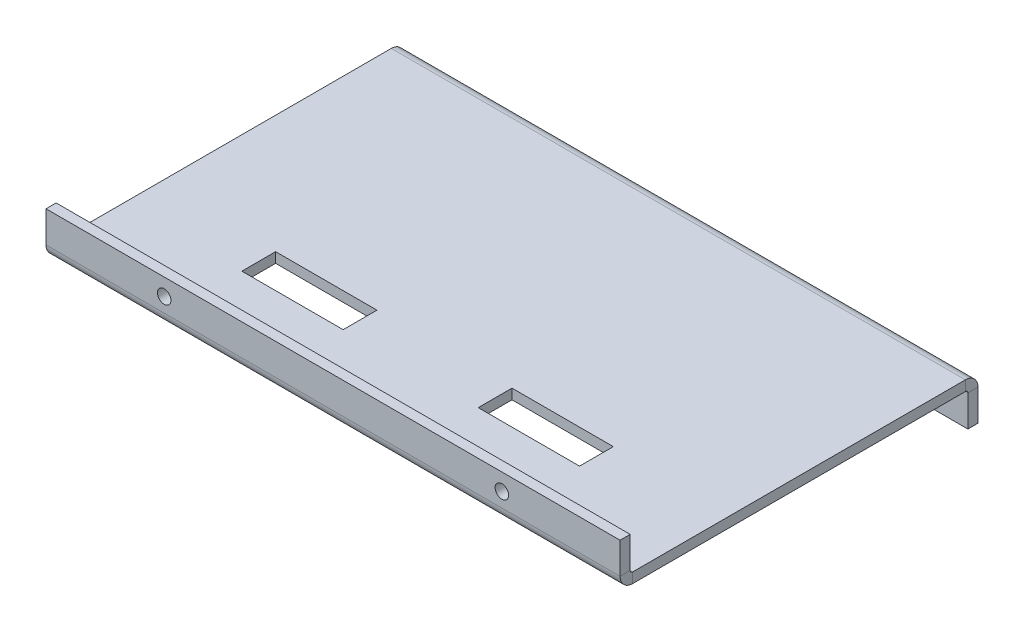
ISO-10303-21;
HEADER;
FILE_DESCRIPTION(('STEP AP214'),'2;1');
FILE_NAME('part.step','',(''),(''),'','','');
FILE_SCHEMA(('AUTOMOTIVE_DESIGN { 1 0 10303 214 1 1 1 1 }'));
ENDSEC;
DATA;
#1=APPLICATION_CONTEXT('core data for automotive mechanical design processes');
#2=APPLICATION_PROTOCOL_DEFINITION('international standard','automotive_design',2000,#1);
#3=PRODUCT_CONTEXT('',#1,'mechanical');
#4=PRODUCT('Part','Part','',(#3));
#5=PRODUCT_RELATED_PRODUCT_CATEGORY('part','',(#4));
#6=PRODUCT_DEFINITION_FORMATION('','',#4);
#7=PRODUCT_DEFINITION_CONTEXT('part definition',#1,'design');
#8=PRODUCT_DEFINITION('design','',#6,#7);
#9=PRODUCT_DEFINITION_SHAPE('','',#8);
#10=(LENGTH_UNIT() NAMED_UNIT(*) SI_UNIT(.MILLI.,.METRE.));
#11=(NAMED_UNIT(*) PLANE_ANGLE_UNIT() SI_UNIT($,.RADIAN.));
#12=(NAMED_UNIT(*) SI_UNIT($,.STERADIAN.) SOLID_ANGLE_UNIT());
#13=UNCERTAINTY_MEASURE_WITH_UNIT(LENGTH_MEASURE(1.E-05),#10,'distance_accuracy_value','');
#14=(GEOMETRIC_REPRESENTATION_CONTEXT(3) GLOBAL_UNCERTAINTY_ASSIGNED_CONTEXT((#13)) GLOBAL_UNIT_ASSIGNED_CONTEXT((#10,
#11,#12)) REPRESENTATION_CONTEXT('',''));
#15=CARTESIAN_POINT('',(0.,0.,0.));
#16=DIRECTION('',(0.,0.,1.));
#17=DIRECTION('',(1.,0.,0.));
#18=AXIS2_PLACEMENT_3D('',#15,#16,#17);
#19=CARTESIAN_POINT('',(85.,-3.,50.));
#20=DIRECTION('',(1.,0.,0.));
#21=DIRECTION('',(0.,0.,-1.));
#22=AXIS2_PLACEMENT_3D('',#19,#20,#21);
#23=PLANE('',#22);
#24=DIRECTION('',(0.,0.,-1.));
#25=VECTOR('',#24,1.);
#26=CARTESIAN_POINT('',(85.,-3.,50.));
#27=LINE('',#26,#25);
#28=CARTESIAN_POINT('',(85.,-3.,49.2634));
#29=VERTEX_POINT('',#28);
#30=CARTESIAN_POINT('',(85.,-3.00000000000001,-49.2634));
#31=VERTEX_POINT('',#30);
#32=EDGE_CURVE('E11',#29,#31,#27,.T.);
#33=ORIENTED_EDGE('',*,*,#32,.T.);
#34=DIRECTION('',(0.,1.,0.));
#35=VECTOR('',#34,1.);
#36=CARTESIAN_POINT('',(85.,-3.00000000000001,-49.2634));
#37=LINE('',#36,#35);
#38=CARTESIAN_POINT('',(85.,0.,-49.2634000000001));
#39=VERTEX_POINT('',#38);
#40=EDGE_CURVE('E311',#31,#39,#37,.T.);
#41=ORIENTED_EDGE('',*,*,#40,.T.);
#42=DIRECTION('',(0.,0.,-1.));
#43=VECTOR('',#42,1.);
#44=CARTESIAN_POINT('',(85.,0.,50.));
#45=LINE('',#44,#43);
#46=CARTESIAN_POINT('',(85.,0.,49.2634));
#47=VERTEX_POINT('',#46);
#48=EDGE_CURVE('E44',#47,#39,#45,.T.);
#49=ORIENTED_EDGE('',*,*,#48,.F.);
#50=DIRECTION('',(0.,-1.,0.));
#51=VECTOR('',#50,1.);
#52=CARTESIAN_POINT('',(85.,0.,49.2634));
#53=LINE('',#52,#51);
#54=EDGE_CURVE('E364',#47,#29,#53,.T.);
#55=ORIENTED_EDGE('',*,*,#54,.T.);
#56=EDGE_LOOP('',(#33,#41,#49,#55));
#57=FACE_BOUND('',#56,.T.);
#58=ADVANCED_FACE('F40',(#57),#23,.T.);
#59=CARTESIAN_POINT('',(0.,-3.,0.));
#60=DIRECTION('',(0.,1.,0.));
#61=DIRECTION('',(0.,0.,1.));
#62=AXIS2_PLACEMENT_3D('',#59,#60,#61);
#63=PLANE('',#62);
#64=DIRECTION('',(1.,0.,0.));
#65=VECTOR('',#64,1.);
#66=CARTESIAN_POINT('',(-50.,-3.,20.));
#67=LINE('',#66,#65);
#68=CARTESIAN_POINT('',(-50.,-3.,20.));
#69=VERTEX_POINT('',#68);
#70=CARTESIAN_POINT('',(-20.,-3.,20.));
#71=VERTEX_POINT('',#70);
#72=EDGE_CURVE('E203',#69,#71,#67,.T.);
#73=ORIENTED_EDGE('',*,*,#72,.F.);
#74=DIRECTION('',(0.,0.,-1.));
#75=VECTOR('',#74,1.);
#76=CARTESIAN_POINT('',(-50.,-3.,20.));
#77=LINE('',#76,#75);
#78=CARTESIAN_POINT('',(-50.,-3.,30.));
#79=VERTEX_POINT('',#78);
#80=EDGE_CURVE('E183',#79,#69,#77,.T.);
#81=ORIENTED_EDGE('',*,*,#80,.F.);
#82=DIRECTION('',(-1.,0.,0.));
#83=VECTOR('',#82,1.);
#84=CARTESIAN_POINT('',(-50.,-3.,30.));
#85=LINE('',#84,#83);
#86=CARTESIAN_POINT('',(-20.,-3.,30.));
#87=VERTEX_POINT('',#86);
#88=EDGE_CURVE('E194',#87,#79,#85,.T.);
#89=ORIENTED_EDGE('',*,*,#88,.F.);
#90=DIRECTION('',(0.,0.,1.));
#91=VECTOR('',#90,1.);
#92=CARTESIAN_POINT('',(-20.,-3.,20.));
#93=LINE('',#92,#91);
#94=EDGE_CURVE('E57',#71,#87,#93,.T.);
#95=ORIENTED_EDGE('',*,*,#94,.F.);
#96=EDGE_LOOP('',(#73,#81,#89,#95));
#97=FACE_BOUND('',#96,.T.);
#98=DIRECTION('',(-1.,0.,0.));
#99=VECTOR('',#98,1.);
#100=CARTESIAN_POINT('',(50.,-3.,29.9999999999999));
#101=LINE('',#100,#99);
#102=CARTESIAN_POINT('',(50.,-3.,29.9999999999999));
#103=VERTEX_POINT('',#102);
#104=CARTESIAN_POINT('',(20.,-3.,30.));
#105=VERTEX_POINT('',#104);
#106=EDGE_CURVE('E221',#103,#105,#101,.T.);
#107=ORIENTED_EDGE('',*,*,#106,.F.);
#108=DIRECTION('',(0.,0.,1.));
#109=VECTOR('',#108,1.);
#110=CARTESIAN_POINT('',(50.,-3.,19.9999999999999));
#111=LINE('',#110,#109);
#112=CARTESIAN_POINT('',(50.,-3.,19.9999999999999));
#113=VERTEX_POINT('',#112);
#114=EDGE_CURVE('E224',#113,#103,#111,.T.);
#115=ORIENTED_EDGE('',*,*,#114,.F.);
#116=DIRECTION('',(1.,0.,0.));
#117=VECTOR('',#116,1.);
#118=CARTESIAN_POINT('',(50.,-3.,19.9999999999999));
#119=LINE('',#118,#117);
#120=CARTESIAN_POINT('',(20.,-3.,20.));
#121=VERTEX_POINT('',#120);
#122=EDGE_CURVE('E241',#121,#113,#119,.T.);
#123=ORIENTED_EDGE('',*,*,#122,.F.);
#124=DIRECTION('',(0.,0.,-1.));
#125=VECTOR('',#124,1.);
#126=CARTESIAN_POINT('',(20.,-3.,20.));
#127=LINE('',#126,#125);
#128=EDGE_CURVE('E65',#105,#121,#127,.T.);
#129=ORIENTED_EDGE('',*,*,#128,.F.);
#130=EDGE_LOOP('',(#107,#115,#123,#129));
#131=FACE_BOUND('',#130,.T.);
#132=DIRECTION('',(1.,0.,0.));
#133=VECTOR('',#132,1.);
#134=CARTESIAN_POINT('',(85.,-3.00000000000001,-49.2634));
#135=LINE('',#134,#133);
#136=CARTESIAN_POINT('',(-85.,-3.00000000000001,-49.2634));
#137=VERTEX_POINT('',#136);
#138=EDGE_CURVE('E317',#31,#137,#135,.F.);
#139=ORIENTED_EDGE('',*,*,#138,.F.);
#140=ORIENTED_EDGE('',*,*,#32,.F.);
#141=DIRECTION('',(1.,0.,0.));
#142=VECTOR('',#141,1.);
#143=CARTESIAN_POINT('',(85.,-3.,49.2634));
#144=LINE('',#143,#142);
#145=CARTESIAN_POINT('',(-84.9999999999999,-3.,49.2634));
#146=VERTEX_POINT('',#145);
#147=EDGE_CURVE('E357',#29,#146,#144,.F.);
#148=ORIENTED_EDGE('',*,*,#147,.T.);
#149=DIRECTION('',(0.,0.,1.));
#150=VECTOR('',#149,1.);
#151=CARTESIAN_POINT('',(-85.,-3.,50.));
#152=LINE('',#151,#150);
#153=EDGE_CURVE('E49',#137,#146,#152,.T.);
#154=ORIENTED_EDGE('',*,*,#153,.F.);
#155=EDGE_LOOP('',(#139,#140,#148,#154));
#156=FACE_BOUND('',#155,.T.);
#157=ADVANCED_FACE('F200',(#97,#131,#156),#63,.F.);
#158=CARTESIAN_POINT('',(0.,0.,0.));
#159=DIRECTION('',(0.,1.,0.));
#160=DIRECTION('',(0.,0.,1.));
#161=AXIS2_PLACEMENT_3D('',#158,#159,#160);
#162=PLANE('',#161);
#163=DIRECTION('',(0.,0.,1.));
#164=VECTOR('',#163,1.);
#165=CARTESIAN_POINT('',(-50.,0.,20.));
#166=LINE('',#165,#164);
#167=CARTESIAN_POINT('',(-50.,0.,20.));
#168=VERTEX_POINT('',#167);
#169=CARTESIAN_POINT('',(-50.,0.,30.));
#170=VERTEX_POINT('',#169);
#171=EDGE_CURVE('E186',#168,#170,#166,.T.);
#172=ORIENTED_EDGE('',*,*,#171,.F.);
#173=DIRECTION('',(-1.,0.,0.));
#174=VECTOR('',#173,1.);
#175=CARTESIAN_POINT('',(-50.,0.,20.));
#176=LINE('',#175,#174);
#177=CARTESIAN_POINT('',(-20.,0.,20.));
#178=VERTEX_POINT('',#177);
#179=EDGE_CURVE('E191',#178,#168,#176,.T.);
#180=ORIENTED_EDGE('',*,*,#179,.F.);
#181=DIRECTION('',(0.,0.,-1.));
#182=VECTOR('',#181,1.);
#183=CARTESIAN_POINT('',(-20.,0.,20.));
#184=LINE('',#183,#182);
#185=CARTESIAN_POINT('',(-20.,0.,30.));
#186=VERTEX_POINT('',#185);
#187=EDGE_CURVE('E211',#186,#178,#184,.T.);
#188=ORIENTED_EDGE('',*,*,#187,.F.);
#189=DIRECTION('',(1.,0.,0.));
#190=VECTOR('',#189,1.);
#191=CARTESIAN_POINT('',(-50.,0.,30.));
#192=LINE('',#191,#190);
#193=EDGE_CURVE('E205',#170,#186,#192,.T.);
#194=ORIENTED_EDGE('',*,*,#193,.F.);
#195=EDGE_LOOP('',(#172,#180,#188,#194));
#196=FACE_BOUND('',#195,.T.);
#197=DIRECTION('',(0.,0.,-1.));
#198=VECTOR('',#197,1.);
#199=CARTESIAN_POINT('',(50.,0.,19.9999999999999));
#200=LINE('',#199,#198);
#201=CARTESIAN_POINT('',(50.,0.,29.9999999999999));
#202=VERTEX_POINT('',#201);
#203=CARTESIAN_POINT('',(50.,0.,19.9999999999999));
#204=VERTEX_POINT('',#203);
#205=EDGE_CURVE('E227',#202,#204,#200,.T.);
#206=ORIENTED_EDGE('',*,*,#205,.F.);
#207=DIRECTION('',(1.,0.,0.));
#208=VECTOR('',#207,1.);
#209=CARTESIAN_POINT('',(50.,0.,29.9999999999999));
#210=LINE('',#209,#208);
#211=CARTESIAN_POINT('',(20.,0.,30.));
#212=VERTEX_POINT('',#211);
#213=EDGE_CURVE('E235',#212,#202,#210,.T.);
#214=ORIENTED_EDGE('',*,*,#213,.F.);
#215=DIRECTION('',(0.,0.,1.));
#216=VECTOR('',#215,1.);
#217=CARTESIAN_POINT('',(20.,0.,20.));
#218=LINE('',#217,#216);
#219=CARTESIAN_POINT('',(20.,0.,20.));
#220=VERTEX_POINT('',#219);
#221=EDGE_CURVE('E232',#220,#212,#218,.T.);
#222=ORIENTED_EDGE('',*,*,#221,.F.);
#223=DIRECTION('',(-1.,0.,0.));
#224=VECTOR('',#223,1.);
#225=CARTESIAN_POINT('',(50.,0.,19.9999999999999));
#226=LINE('',#225,#224);
#227=EDGE_CURVE('E229',#204,#220,#226,.T.);
#228=ORIENTED_EDGE('',*,*,#227,.F.);
#229=EDGE_LOOP('',(#206,#214,#222,#228));
#230=FACE_BOUND('',#229,.T.);
#231=ORIENTED_EDGE('',*,*,#48,.T.);
#232=DIRECTION('',(1.,0.,0.));
#233=VECTOR('',#232,1.);
#234=CARTESIAN_POINT('',(85.,0.,-49.2634000000001));
#235=LINE('',#234,#233);
#236=CARTESIAN_POINT('',(-85.,0.,-49.2634));
#237=VERTEX_POINT('',#236);
#238=EDGE_CURVE('E304',#39,#237,#235,.F.);
#239=ORIENTED_EDGE('',*,*,#238,.T.);
#240=DIRECTION('',(0.,0.,1.));
#241=VECTOR('',#240,1.);
#242=CARTESIAN_POINT('',(-85.,0.,50.));
#243=LINE('',#242,#241);
#244=CARTESIAN_POINT('',(-84.9999999999999,0.,49.2634));
#245=VERTEX_POINT('',#244);
#246=EDGE_CURVE('E378',#237,#245,#243,.T.);
#247=ORIENTED_EDGE('',*,*,#246,.T.);
#248=DIRECTION('',(1.,0.,0.));
#249=VECTOR('',#248,1.);
#250=CARTESIAN_POINT('',(85.,0.,49.2634));
#251=LINE('',#250,#249);
#252=EDGE_CURVE('E370',#47,#245,#251,.F.);
#253=ORIENTED_EDGE('',*,*,#252,.F.);
#254=EDGE_LOOP('',(#231,#239,#247,#253));
#255=FACE_BOUND('',#254,.T.);
#256=ADVANCED_FACE('F386',(#196,#230,#255),#162,.T.);
#257=CARTESIAN_POINT('',(-85.,-3.,50.));
#258=DIRECTION('',(-1.,0.,0.));
#259=DIRECTION('',(0.,0.,1.));
#260=AXIS2_PLACEMENT_3D('',#257,#258,#259);
#261=PLANE('',#260);
#262=DIRECTION('',(0.,1.,0.));
#263=VECTOR('',#262,1.);
#264=CARTESIAN_POINT('',(-85.,-3.00000000000001,-49.2634));
#265=LINE('',#264,#263);
#266=EDGE_CURVE('E321',#137,#237,#265,.T.);
#267=ORIENTED_EDGE('',*,*,#266,.F.);
#268=ORIENTED_EDGE('',*,*,#153,.T.);
#269=DIRECTION('',(0.,-1.,0.));
#270=VECTOR('',#269,1.);
#271=CARTESIAN_POINT('',(-84.9999999999999,0.,49.2634));
#272=LINE('',#271,#270);
#273=EDGE_CURVE('E375',#245,#146,#272,.T.);
#274=ORIENTED_EDGE('',*,*,#273,.F.);
#275=ORIENTED_EDGE('',*,*,#246,.F.);
#276=EDGE_LOOP('',(#267,#268,#274,#275));
#277=FACE_BOUND('',#276,.T.);
#278=ADVANCED_FACE('F42',(#277),#261,.T.);
#279=CARTESIAN_POINT('',(-85.,0.736599999999993,49.2634));
#280=DIRECTION('',(-1.,0.,0.));
#281=DIRECTION('',(0.,0.,1.));
#282=AXIS2_PLACEMENT_3D('',#279,#280,#281);
#283=PLANE('',#282);
#284=DIRECTION('',(0.,0.,1.));
#285=VECTOR('',#284,1.);
#286=CARTESIAN_POINT('',(-85.,0.736599999999997,50.));
#287=LINE('',#286,#285);
#288=CARTESIAN_POINT('',(-84.9999999999999,0.736599999999993,50.));
#289=VERTEX_POINT('',#288);
#290=CARTESIAN_POINT('',(-84.9999999999999,0.736599999999993,53.));
#291=VERTEX_POINT('',#290);
#292=EDGE_CURVE('E324',#289,#291,#287,.T.);
#293=ORIENTED_EDGE('',*,*,#292,.F.);
#294=CARTESIAN_POINT('',(-85.,0.736599999999993,49.2634));
#295=DIRECTION('',(1.,0.,0.));
#296=DIRECTION('',(0.,0.,-1.));
#297=AXIS2_PLACEMENT_3D('',#294,#295,#296);
#298=CIRCLE('',#297,0.736599999999997);
#299=EDGE_CURVE('E367',#245,#289,#298,.F.);
#300=ORIENTED_EDGE('',*,*,#299,.F.);
#301=ORIENTED_EDGE('',*,*,#273,.T.);
#302=CARTESIAN_POINT('',(-84.9999999999999,0.736599999999993,49.2634));
#303=DIRECTION('',(1.,0.,0.));
#304=DIRECTION('',(0.,0.,-1.));
#305=AXIS2_PLACEMENT_3D('',#302,#303,#304);
#306=CIRCLE('',#305,3.7366);
#307=EDGE_CURVE('E360',#146,#291,#306,.F.);
#308=ORIENTED_EDGE('',*,*,#307,.T.);
#309=EDGE_LOOP('',(#293,#300,#301,#308));
#310=FACE_BOUND('',#309,.T.);
#311=ADVANCED_FACE('F421',(#310),#283,.T.);
#312=CARTESIAN_POINT('',(85.,0.736599999999993,49.2634));
#313=DIRECTION('',(-1.,0.,0.));
#314=DIRECTION('',(0.,0.,1.));
#315=AXIS2_PLACEMENT_3D('',#312,#313,#314);
#316=PLANE('',#315);
#317=CARTESIAN_POINT('',(85.,0.736599999999993,49.2634));
#318=DIRECTION('',(1.,0.,0.));
#319=DIRECTION('',(0.,0.,-1.));
#320=AXIS2_PLACEMENT_3D('',#317,#318,#319);
#321=CIRCLE('',#320,0.736599999999997);
#322=CARTESIAN_POINT('',(85.,0.736599999999993,50.));
#323=VERTEX_POINT('',#322);
#324=EDGE_CURVE('E356',#323,#47,#321,.T.);
#325=ORIENTED_EDGE('',*,*,#324,.F.);
#326=DIRECTION('',(0.,0.,1.));
#327=VECTOR('',#326,1.);
#328=CARTESIAN_POINT('',(85.,0.73659999999999,50.));
#329=LINE('',#328,#327);
#330=CARTESIAN_POINT('',(85.,0.73659999999999,53.));
#331=VERTEX_POINT('',#330);
#332=EDGE_CURVE('E329',#323,#331,#329,.T.);
#333=ORIENTED_EDGE('',*,*,#332,.T.);
#334=CARTESIAN_POINT('',(85.,0.736599999999993,49.2634));
#335=DIRECTION('',(1.,0.,0.));
#336=DIRECTION('',(0.,0.,-1.));
#337=AXIS2_PLACEMENT_3D('',#334,#335,#336);
#338=CIRCLE('',#337,3.7366);
#339=EDGE_CURVE('E361',#331,#29,#338,.T.);
#340=ORIENTED_EDGE('',*,*,#339,.T.);
#341=ORIENTED_EDGE('',*,*,#54,.F.);
#342=EDGE_LOOP('',(#325,#333,#340,#341));
#343=FACE_BOUND('',#342,.T.);
#344=ADVANCED_FACE('F392',(#343),#316,.F.);
#345=CARTESIAN_POINT('',(85.,0.736599999999993,49.2634));
#346=DIRECTION('',(1.,0.,0.));
#347=DIRECTION('',(0.,0.,1.));
#348=AXIS2_PLACEMENT_3D('',#345,#346,#347);
#349=CYLINDRICAL_SURFACE('',#348,3.7366);
#350=ORIENTED_EDGE('',*,*,#147,.F.);
#351=ORIENTED_EDGE('',*,*,#339,.F.);
#352=DIRECTION('',(-1.,0.,0.));
#353=VECTOR('',#352,1.);
#354=CARTESIAN_POINT('',(0.,0.736599999999993,53.));
#355=LINE('',#354,#353);
#356=EDGE_CURVE('E332',#331,#291,#355,.T.);
#357=ORIENTED_EDGE('',*,*,#356,.T.);
#358=ORIENTED_EDGE('',*,*,#307,.F.);
#359=EDGE_LOOP('',(#350,#351,#357,#358));
#360=FACE_BOUND('',#359,.T.);
#361=ADVANCED_FACE('F419',(#360),#349,.T.);
#362=CARTESIAN_POINT('',(85.,0.736599999999993,49.2634));
#363=DIRECTION('',(1.,0.,0.));
#364=DIRECTION('',(0.,0.,1.));
#365=AXIS2_PLACEMENT_3D('',#362,#363,#364);
#366=CYLINDRICAL_SURFACE('',#365,0.736599999999997);
#367=ORIENTED_EDGE('',*,*,#252,.T.);
#368=ORIENTED_EDGE('',*,*,#299,.T.);
#369=DIRECTION('',(1.,0.,0.));
#370=VECTOR('',#369,1.);
#371=CARTESIAN_POINT('',(-85.,0.736599999999997,50.));
#372=LINE('',#371,#370);
#373=EDGE_CURVE('E327',#289,#323,#372,.T.);
#374=ORIENTED_EDGE('',*,*,#373,.T.);
#375=ORIENTED_EDGE('',*,*,#324,.T.);
#376=EDGE_LOOP('',(#367,#368,#374,#375));
#377=FACE_BOUND('',#376,.T.);
#378=ADVANCED_FACE('F395',(#377),#366,.F.);
#379=CARTESIAN_POINT('',(-85.,0.,53.));
#380=DIRECTION('',(1.,0.,0.));
#381=DIRECTION('',(0.,1.,0.));
#382=AXIS2_PLACEMENT_3D('',#379,#380,#381);
#383=PLANE('',#382);
#384=ORIENTED_EDGE('',*,*,#292,.T.);
#385=DIRECTION('',(0.,-1.,0.));
#386=VECTOR('',#385,1.);
#387=CARTESIAN_POINT('',(-85.,0.,53.));
#388=LINE('',#387,#386);
#389=CARTESIAN_POINT('',(-85.,10.,53.));
#390=VERTEX_POINT('',#389);
#391=EDGE_CURVE('E337',#390,#291,#388,.T.);
#392=ORIENTED_EDGE('',*,*,#391,.F.);
#393=DIRECTION('',(0.,0.,-1.));
#394=VECTOR('',#393,1.);
#395=CARTESIAN_POINT('',(-85.,10.,53.));
#396=LINE('',#395,#394);
#397=CARTESIAN_POINT('',(-85.,10.,50.));
#398=VERTEX_POINT('',#397);
#399=EDGE_CURVE('E345',#390,#398,#396,.T.);
#400=ORIENTED_EDGE('',*,*,#399,.T.);
#401=DIRECTION('',(0.,-1.,0.));
#402=VECTOR('',#401,1.);
#403=CARTESIAN_POINT('',(-85.,0.,50.));
#404=LINE('',#403,#402);
#405=EDGE_CURVE('E336',#398,#289,#404,.T.);
#406=ORIENTED_EDGE('',*,*,#405,.T.);
#407=EDGE_LOOP('',(#384,#392,#400,#406));
#408=FACE_BOUND('',#407,.T.);
#409=ADVANCED_FACE('F404',(#408),#383,.F.);
#410=CARTESIAN_POINT('',(85.,10.,53.));
#411=DIRECTION('',(-1.,0.,0.));
#412=DIRECTION('',(0.,-1.,0.));
#413=AXIS2_PLACEMENT_3D('',#410,#411,#412);
#414=PLANE('',#413);
#415=ORIENTED_EDGE('',*,*,#332,.F.);
#416=DIRECTION('',(0.,1.,0.));
#417=VECTOR('',#416,1.);
#418=CARTESIAN_POINT('',(85.,10.,50.));
#419=LINE('',#418,#417);
#420=CARTESIAN_POINT('',(85.,10.,50.));
#421=VERTEX_POINT('',#420);
#422=EDGE_CURVE('E348',#323,#421,#419,.T.);
#423=ORIENTED_EDGE('',*,*,#422,.T.);
#424=DIRECTION('',(0.,0.,-1.));
#425=VECTOR('',#424,1.);
#426=CARTESIAN_POINT('',(85.,10.,53.));
#427=LINE('',#426,#425);
#428=CARTESIAN_POINT('',(85.,10.,53.));
#429=VERTEX_POINT('',#428);
#430=EDGE_CURVE('E353',#429,#421,#427,.T.);
#431=ORIENTED_EDGE('',*,*,#430,.F.);
#432=DIRECTION('',(0.,1.,0.));
#433=VECTOR('',#432,1.);
#434=CARTESIAN_POINT('',(85.,10.,53.));
#435=LINE('',#434,#433);
#436=EDGE_CURVE('E340',#331,#429,#435,.T.);
#437=ORIENTED_EDGE('',*,*,#436,.F.);
#438=EDGE_LOOP('',(#415,#423,#431,#437));
#439=FACE_BOUND('',#438,.T.);
#440=ADVANCED_FACE('F413',(#439),#414,.F.);
#441=CARTESIAN_POINT('',(0.,0.,53.));
#442=DIRECTION('',(0.,0.,-1.));
#443=DIRECTION('',(-1.,0.,0.));
#444=AXIS2_PLACEMENT_3D('',#441,#442,#443);
#445=PLANE('',#444);
#446=CARTESIAN_POINT('',(-50.,5.00000000000001,53.));
#447=DIRECTION('',(0.,0.,1.));
#448=DIRECTION('',(1.,0.,0.));
#449=AXIS2_PLACEMENT_3D('',#446,#447,#448);
#450=CIRCLE('',#449,2.);
#451=CARTESIAN_POINT('',(-48.,5.00000000000001,53.));
#452=VERTEX_POINT('',#451);
#453=EDGE_CURVE('E262',#452,#452,#450,.T.);
#454=ORIENTED_EDGE('',*,*,#453,.F.);
#455=EDGE_LOOP('',(#454));
#456=FACE_BOUND('',#455,.T.);
#457=CARTESIAN_POINT('',(50.,5.00000000000002,53.));
#458=DIRECTION('',(0.,0.,1.));
#459=DIRECTION('',(-1.,0.,0.));
#460=AXIS2_PLACEMENT_3D('',#457,#458,#459);
#461=CIRCLE('',#460,2.);
#462=CARTESIAN_POINT('',(48.,5.00000000000002,53.));
#463=VERTEX_POINT('',#462);
#464=EDGE_CURVE('E269',#463,#463,#461,.T.);
#465=ORIENTED_EDGE('',*,*,#464,.F.);
#466=EDGE_LOOP('',(#465));
#467=FACE_BOUND('',#466,.T.);
#468=ORIENTED_EDGE('',*,*,#356,.F.);
#469=ORIENTED_EDGE('',*,*,#436,.T.);
#470=DIRECTION('',(-1.,0.,0.));
#471=VECTOR('',#470,1.);
#472=CARTESIAN_POINT('',(-85.,10.,53.));
#473=LINE('',#472,#471);
#474=EDGE_CURVE('E343',#429,#390,#473,.T.);
#475=ORIENTED_EDGE('',*,*,#474,.T.);
#476=ORIENTED_EDGE('',*,*,#391,.T.);
#477=EDGE_LOOP('',(#468,#469,#475,#476));
#478=FACE_BOUND('',#477,.T.);
#479=ADVANCED_FACE('F416',(#456,#467,#478),#445,.F.);
#480=CARTESIAN_POINT('',(0.,0.,50.));
#481=DIRECTION('',(0.,0.,-1.));
#482=DIRECTION('',(-1.,0.,0.));
#483=AXIS2_PLACEMENT_3D('',#480,#481,#482);
#484=PLANE('',#483);
#485=CARTESIAN_POINT('',(-50.,5.00000000000001,50.));
#486=DIRECTION('',(0.,0.,-1.));
#487=DIRECTION('',(-1.,0.,0.));
#488=AXIS2_PLACEMENT_3D('',#485,#486,#487);
#489=CIRCLE('',#488,2.);
#490=CARTESIAN_POINT('',(-52.,5.00000000000001,50.));
#491=VERTEX_POINT('',#490);
#492=EDGE_CURVE('E266',#491,#491,#489,.F.);
#493=ORIENTED_EDGE('',*,*,#492,.T.);
#494=EDGE_LOOP('',(#493));
#495=FACE_BOUND('',#494,.T.);
#496=CARTESIAN_POINT('',(50.,5.00000000000002,50.));
#497=DIRECTION('',(0.,0.,-1.));
#498=DIRECTION('',(-1.,0.,0.));
#499=AXIS2_PLACEMENT_3D('',#496,#497,#498);
#500=CIRCLE('',#499,2.);
#501=CARTESIAN_POINT('',(48.,5.00000000000002,50.));
#502=VERTEX_POINT('',#501);
#503=EDGE_CURVE('E253',#502,#502,#500,.F.);
#504=ORIENTED_EDGE('',*,*,#503,.T.);
#505=EDGE_LOOP('',(#504));
#506=FACE_BOUND('',#505,.T.);
#507=ORIENTED_EDGE('',*,*,#422,.F.);
#508=ORIENTED_EDGE('',*,*,#373,.F.);
#509=ORIENTED_EDGE('',*,*,#405,.F.);
#510=DIRECTION('',(-1.,0.,0.));
#511=VECTOR('',#510,1.);
#512=CARTESIAN_POINT('',(-85.,10.,50.));
#513=LINE('',#512,#511);
#514=EDGE_CURVE('E341',#421,#398,#513,.T.);
#515=ORIENTED_EDGE('',*,*,#514,.F.);
#516=EDGE_LOOP('',(#507,#508,#509,#515));
#517=FACE_BOUND('',#516,.T.);
#518=ADVANCED_FACE('F401',(#495,#506,#517),#484,.T.);
#519=CARTESIAN_POINT('',(-85.,10.,53.));
#520=DIRECTION('',(0.,-1.,0.));
#521=DIRECTION('',(0.,0.,-1.));
#522=AXIS2_PLACEMENT_3D('',#519,#520,#521);
#523=PLANE('',#522);
#524=ORIENTED_EDGE('',*,*,#514,.T.);
#525=ORIENTED_EDGE('',*,*,#399,.F.);
#526=ORIENTED_EDGE('',*,*,#474,.F.);
#527=ORIENTED_EDGE('',*,*,#430,.T.);
#528=EDGE_LOOP('',(#524,#525,#526,#527));
#529=FACE_BOUND('',#528,.T.);
#530=ADVANCED_FACE('F409',(#529),#523,.F.);
#531=CARTESIAN_POINT('',(-85.,-3.7366,-49.2634));
#532=DIRECTION('',(-1.,0.,0.));
#533=DIRECTION('',(0.,0.,1.));
#534=AXIS2_PLACEMENT_3D('',#531,#532,#533);
#535=PLANE('',#534);
#536=DIRECTION('',(0.,0.,-1.));
#537=VECTOR('',#536,1.);
#538=CARTESIAN_POINT('',(-85.,-3.7366,-50.));
#539=LINE('',#538,#537);
#540=CARTESIAN_POINT('',(-85.,-3.73659999999999,-50.));
#541=VERTEX_POINT('',#540);
#542=CARTESIAN_POINT('',(-85.,-3.73659999999998,-53.));
#543=VERTEX_POINT('',#542);
#544=EDGE_CURVE('E265',#541,#543,#539,.T.);
#545=ORIENTED_EDGE('',*,*,#544,.F.);
#546=CARTESIAN_POINT('',(-85.,-3.7366,-49.2634));
#547=DIRECTION('',(1.,0.,0.));
#548=DIRECTION('',(0.,0.,-1.));
#549=AXIS2_PLACEMENT_3D('',#546,#547,#548);
#550=CIRCLE('',#549,0.73659999999999);
#551=EDGE_CURVE('E314',#137,#541,#550,.F.);
#552=ORIENTED_EDGE('',*,*,#551,.F.);
#553=ORIENTED_EDGE('',*,*,#266,.T.);
#554=CARTESIAN_POINT('',(-85.,-3.7366,-49.2634));
#555=DIRECTION('',(1.,0.,0.));
#556=DIRECTION('',(0.,0.,-1.));
#557=AXIS2_PLACEMENT_3D('',#554,#555,#556);
#558=CIRCLE('',#557,3.73659999999999);
#559=EDGE_CURVE('E307',#237,#543,#558,.F.);
#560=ORIENTED_EDGE('',*,*,#559,.T.);
#561=EDGE_LOOP('',(#545,#552,#553,#560));
#562=FACE_BOUND('',#561,.T.);
#563=ADVANCED_FACE('F433',(#562),#535,.T.);
#564=CARTESIAN_POINT('',(85.,-3.7366,-49.2634));
#565=DIRECTION('',(-1.,0.,0.));
#566=DIRECTION('',(0.,0.,1.));
#567=AXIS2_PLACEMENT_3D('',#564,#565,#566);
#568=PLANE('',#567);
#569=CARTESIAN_POINT('',(85.,-3.7366,-49.2634));
#570=DIRECTION('',(1.,0.,0.));
#571=DIRECTION('',(0.,0.,-1.));
#572=AXIS2_PLACEMENT_3D('',#569,#570,#571);
#573=CIRCLE('',#572,0.73659999999999);
#574=CARTESIAN_POINT('',(85.,-3.73659999999999,-50.));
#575=VERTEX_POINT('',#574);
#576=EDGE_CURVE('E303',#575,#31,#573,.T.);
#577=ORIENTED_EDGE('',*,*,#576,.F.);
#578=DIRECTION('',(0.,0.,-1.));
#579=VECTOR('',#578,1.);
#580=CARTESIAN_POINT('',(85.,-3.73659999999999,-50.));
#581=LINE('',#580,#579);
#582=CARTESIAN_POINT('',(85.,-3.73659999999997,-53.));
#583=VERTEX_POINT('',#582);
#584=EDGE_CURVE('E276',#575,#583,#581,.T.);
#585=ORIENTED_EDGE('',*,*,#584,.T.);
#586=CARTESIAN_POINT('',(85.,-3.7366,-49.2634));
#587=DIRECTION('',(1.,0.,0.));
#588=DIRECTION('',(0.,0.,-1.));
#589=AXIS2_PLACEMENT_3D('',#586,#587,#588);
#590=CIRCLE('',#589,3.73659999999999);
#591=EDGE_CURVE('E308',#583,#39,#590,.T.);
#592=ORIENTED_EDGE('',*,*,#591,.T.);
#593=ORIENTED_EDGE('',*,*,#40,.F.);
#594=EDGE_LOOP('',(#577,#585,#592,#593));
#595=FACE_BOUND('',#594,.T.);
#596=ADVANCED_FACE('F453',(#595),#568,.F.);
#597=CARTESIAN_POINT('',(85.,-3.7366,-49.2634));
#598=DIRECTION('',(1.,0.,0.));
#599=DIRECTION('',(0.,0.,-1.));
#600=AXIS2_PLACEMENT_3D('',#597,#598,#599);
#601=CYLINDRICAL_SURFACE('',#600,3.73659999999999);
#602=ORIENTED_EDGE('',*,*,#238,.F.);
#603=ORIENTED_EDGE('',*,*,#591,.F.);
#604=DIRECTION('',(-1.,0.,0.));
#605=VECTOR('',#604,1.);
#606=CARTESIAN_POINT('',(0.,-3.73659999999997,-53.));
#607=LINE('',#606,#605);
#608=EDGE_CURVE('E279',#583,#543,#607,.T.);
#609=ORIENTED_EDGE('',*,*,#608,.T.);
#610=ORIENTED_EDGE('',*,*,#559,.F.);
#611=EDGE_LOOP('',(#602,#603,#609,#610));
#612=FACE_BOUND('',#611,.T.);
#613=ADVANCED_FACE('F463',(#612),#601,.T.);
#614=CARTESIAN_POINT('',(85.,-3.7366,-49.2634));
#615=DIRECTION('',(1.,0.,0.));
#616=DIRECTION('',(0.,0.,-1.));
#617=AXIS2_PLACEMENT_3D('',#614,#615,#616);
#618=CYLINDRICAL_SURFACE('',#617,0.73659999999999);
#619=ORIENTED_EDGE('',*,*,#138,.T.);
#620=ORIENTED_EDGE('',*,*,#551,.T.);
#621=DIRECTION('',(1.,0.,0.));
#622=VECTOR('',#621,1.);
#623=CARTESIAN_POINT('',(-85.,-3.7366,-50.));
#624=LINE('',#623,#622);
#625=EDGE_CURVE('E274',#541,#575,#624,.T.);
#626=ORIENTED_EDGE('',*,*,#625,.T.);
#627=ORIENTED_EDGE('',*,*,#576,.T.);
#628=EDGE_LOOP('',(#619,#620,#626,#627));
#629=FACE_BOUND('',#628,.T.);
#630=ADVANCED_FACE('F429',(#629),#618,.F.);
#631=CARTESIAN_POINT('',(85.,-13.,-53.0000000000001));
#632=DIRECTION('',(-1.,0.,0.));
#633=DIRECTION('',(0.,-1.,0.));
#634=AXIS2_PLACEMENT_3D('',#631,#632,#633);
#635=PLANE('',#634);
#636=ORIENTED_EDGE('',*,*,#584,.F.);
#637=DIRECTION('',(0.,-1.,0.));
#638=VECTOR('',#637,1.);
#639=CARTESIAN_POINT('',(85.,-13.,-50.0000000000001));
#640=LINE('',#639,#638);
#641=CARTESIAN_POINT('',(85.,-13.,-50.0000000000001));
#642=VERTEX_POINT('',#641);
#643=EDGE_CURVE('E283',#575,#642,#640,.T.);
#644=ORIENTED_EDGE('',*,*,#643,.T.);
#645=DIRECTION('',(0.,0.,1.));
#646=VECTOR('',#645,1.);
#647=CARTESIAN_POINT('',(85.,-13.,-53.0000000000001));
#648=LINE('',#647,#646);
#649=CARTESIAN_POINT('',(85.,-13.,-53.0000000000001));
#650=VERTEX_POINT('',#649);
#651=EDGE_CURVE('E300',#650,#642,#648,.T.);
#652=ORIENTED_EDGE('',*,*,#651,.F.);
#653=DIRECTION('',(0.,-1.,0.));
#654=VECTOR('',#653,1.);
#655=CARTESIAN_POINT('',(85.,-13.,-53.0000000000001));
#656=LINE('',#655,#654);
#657=EDGE_CURVE('E284',#583,#650,#656,.T.);
#658=ORIENTED_EDGE('',*,*,#657,.F.);
#659=EDGE_LOOP('',(#636,#644,#652,#658));
#660=FACE_BOUND('',#659,.T.);
#661=ADVANCED_FACE('F455',(#660),#635,.F.);
#662=CARTESIAN_POINT('',(-85.,-2.99999999999999,-53.));
#663=DIRECTION('',(1.,0.,0.));
#664=DIRECTION('',(0.,1.,0.));
#665=AXIS2_PLACEMENT_3D('',#662,#663,#664);
#666=PLANE('',#665);
#667=ORIENTED_EDGE('',*,*,#544,.T.);
#668=DIRECTION('',(0.,1.,0.));
#669=VECTOR('',#668,1.);
#670=CARTESIAN_POINT('',(-85.,-2.99999999999999,-53.));
#671=LINE('',#670,#669);
#672=CARTESIAN_POINT('',(-85.,-13.,-53.));
#673=VERTEX_POINT('',#672);
#674=EDGE_CURVE('E289',#673,#543,#671,.T.);
#675=ORIENTED_EDGE('',*,*,#674,.F.);
#676=DIRECTION('',(0.,0.,1.));
#677=VECTOR('',#676,1.);
#678=CARTESIAN_POINT('',(-85.,-13.,-53.));
#679=LINE('',#678,#677);
#680=CARTESIAN_POINT('',(-85.,-13.,-50.));
#681=VERTEX_POINT('',#680);
#682=EDGE_CURVE('E292',#673,#681,#679,.T.);
#683=ORIENTED_EDGE('',*,*,#682,.T.);
#684=DIRECTION('',(0.,1.,0.));
#685=VECTOR('',#684,1.);
#686=CARTESIAN_POINT('',(-85.,-3.,-50.));
#687=LINE('',#686,#685);
#688=EDGE_CURVE('E287',#681,#541,#687,.T.);
#689=ORIENTED_EDGE('',*,*,#688,.T.);
#690=EDGE_LOOP('',(#667,#675,#683,#689));
#691=FACE_BOUND('',#690,.T.);
#692=ADVANCED_FACE('F436',(#691),#666,.F.);
#693=CARTESIAN_POINT('',(0.,2.18641261133746E-13,-53.));
#694=DIRECTION('',(0.,0.,1.));
#695=DIRECTION('',(0.,-1.,0.));
#696=AXIS2_PLACEMENT_3D('',#693,#694,#695);
#697=PLANE('',#696);
#698=CARTESIAN_POINT('',(50.,-7.99999999999999,-53.));
#699=DIRECTION('',(0.,0.,-1.));
#700=DIRECTION('',(0.,1.,0.));
#701=AXIS2_PLACEMENT_3D('',#698,#699,#700);
#702=CIRCLE('',#701,2.);
#703=CARTESIAN_POINT('',(50.,-5.99999999999999,-53.));
#704=VERTEX_POINT('',#703);
#705=EDGE_CURVE('E250',#704,#704,#702,.T.);
#706=ORIENTED_EDGE('',*,*,#705,.F.);
#707=EDGE_LOOP('',(#706));
#708=FACE_BOUND('',#707,.T.);
#709=CARTESIAN_POINT('',(-50.,-7.99999999999998,-53.));
#710=DIRECTION('',(0.,0.,-1.));
#711=DIRECTION('',(0.,-1.,0.));
#712=AXIS2_PLACEMENT_3D('',#709,#710,#711);
#713=CIRCLE('',#712,2.);
#714=CARTESIAN_POINT('',(-50.,-9.99999999999998,-53.));
#715=VERTEX_POINT('',#714);
#716=EDGE_CURVE('E257',#715,#715,#713,.T.);
#717=ORIENTED_EDGE('',*,*,#716,.F.);
#718=EDGE_LOOP('',(#717));
#719=FACE_BOUND('',#718,.T.);
#720=ORIENTED_EDGE('',*,*,#608,.F.);
#721=ORIENTED_EDGE('',*,*,#657,.T.);
#722=DIRECTION('',(-1.,0.,0.));
#723=VECTOR('',#722,1.);
#724=CARTESIAN_POINT('',(-85.,-13.,-53.));
#725=LINE('',#724,#723);
#726=EDGE_CURVE('E286',#650,#673,#725,.T.);
#727=ORIENTED_EDGE('',*,*,#726,.T.);
#728=ORIENTED_EDGE('',*,*,#674,.T.);
#729=EDGE_LOOP('',(#720,#721,#727,#728));
#730=FACE_BOUND('',#729,.T.);
#731=ADVANCED_FACE('F440',(#708,#719,#730),#697,.F.);
#732=CARTESIAN_POINT('',(0.,2.08166817117217E-13,-50.));
#733=DIRECTION('',(0.,0.,1.));
#734=DIRECTION('',(0.,-1.,0.));
#735=AXIS2_PLACEMENT_3D('',#732,#733,#734);
#736=PLANE('',#735);
#737=CARTESIAN_POINT('',(50.,-8.,-50.));
#738=DIRECTION('',(0.,0.,1.));
#739=DIRECTION('',(0.,-1.,0.));
#740=AXIS2_PLACEMENT_3D('',#737,#738,#739);
#741=CIRCLE('',#740,2.);
#742=CARTESIAN_POINT('',(50.,-10.,-50.));
#743=VERTEX_POINT('',#742);
#744=EDGE_CURVE('E254',#743,#743,#741,.F.);
#745=ORIENTED_EDGE('',*,*,#744,.T.);
#746=EDGE_LOOP('',(#745));
#747=FACE_BOUND('',#746,.T.);
#748=CARTESIAN_POINT('',(-50.,-7.99999999999999,-50.));
#749=DIRECTION('',(0.,0.,1.));
#750=DIRECTION('',(0.,-1.,0.));
#751=AXIS2_PLACEMENT_3D('',#748,#749,#750);
#752=CIRCLE('',#751,2.);
#753=CARTESIAN_POINT('',(-50.,-9.99999999999999,-50.));
#754=VERTEX_POINT('',#753);
#755=EDGE_CURVE('E197',#754,#754,#752,.F.);
#756=ORIENTED_EDGE('',*,*,#755,.T.);
#757=EDGE_LOOP('',(#756));
#758=FACE_BOUND('',#757,.T.);
#759=ORIENTED_EDGE('',*,*,#643,.F.);
#760=ORIENTED_EDGE('',*,*,#625,.F.);
#761=ORIENTED_EDGE('',*,*,#688,.F.);
#762=DIRECTION('',(-1.,0.,0.));
#763=VECTOR('',#762,1.);
#764=CARTESIAN_POINT('',(-85.,-13.,-50.));
#765=LINE('',#764,#763);
#766=EDGE_CURVE('E294',#642,#681,#765,.T.);
#767=ORIENTED_EDGE('',*,*,#766,.F.);
#768=EDGE_LOOP('',(#759,#760,#761,#767));
#769=FACE_BOUND('',#768,.T.);
#770=ADVANCED_FACE('F450',(#747,#758,#769),#736,.T.);
#771=CARTESIAN_POINT('',(-85.,-13.,-53.));
#772=DIRECTION('',(0.,1.,0.));
#773=DIRECTION('',(0.,0.,1.));
#774=AXIS2_PLACEMENT_3D('',#771,#772,#773);
#775=PLANE('',#774);
#776=ORIENTED_EDGE('',*,*,#766,.T.);
#777=ORIENTED_EDGE('',*,*,#682,.F.);
#778=ORIENTED_EDGE('',*,*,#726,.F.);
#779=ORIENTED_EDGE('',*,*,#651,.T.);
#780=EDGE_LOOP('',(#776,#777,#778,#779));
#781=FACE_BOUND('',#780,.T.);
#782=ADVANCED_FACE('F446',(#781),#775,.F.);
#783=CARTESIAN_POINT('',(50.,5.00000000000002,-53.0010000000001));
#784=DIRECTION('',(0.,0.,1.));
#785=DIRECTION('',(1.,0.,0.));
#786=AXIS2_PLACEMENT_3D('',#783,#784,#785);
#787=CYLINDRICAL_SURFACE('',#786,2.);
#788=ORIENTED_EDGE('',*,*,#503,.F.);
#789=EDGE_LOOP('',(#788));
#790=FACE_BOUND('',#789,.T.);
#791=ORIENTED_EDGE('',*,*,#464,.T.);
#792=EDGE_LOOP('',(#791));
#793=FACE_BOUND('',#792,.T.);
#794=ADVANCED_FACE('F534',(#790,#793),#787,.F.);
#795=CARTESIAN_POINT('',(-50.,5.00000000000001,-53.0010000000001));
#796=DIRECTION('',(0.,0.,1.));
#797=DIRECTION('',(1.,0.,0.));
#798=AXIS2_PLACEMENT_3D('',#795,#796,#797);
#799=CYLINDRICAL_SURFACE('',#798,2.);
#800=ORIENTED_EDGE('',*,*,#492,.F.);
#801=EDGE_LOOP('',(#800));
#802=FACE_BOUND('',#801,.T.);
#803=ORIENTED_EDGE('',*,*,#453,.T.);
#804=EDGE_LOOP('',(#803));
#805=FACE_BOUND('',#804,.T.);
#806=ADVANCED_FACE('F561',(#802,#805),#799,.F.);
#807=CARTESIAN_POINT('',(-50.,-8.00000000000042,53.001));
#808=DIRECTION('',(0.,0.,-1.));
#809=DIRECTION('',(0.,1.,0.));
#810=AXIS2_PLACEMENT_3D('',#807,#808,#809);
#811=CYLINDRICAL_SURFACE('',#810,2.);
#812=ORIENTED_EDGE('',*,*,#755,.F.);
#813=EDGE_LOOP('',(#812));
#814=FACE_BOUND('',#813,.T.);
#815=ORIENTED_EDGE('',*,*,#716,.T.);
#816=EDGE_LOOP('',(#815));
#817=FACE_BOUND('',#816,.T.);
#818=ADVANCED_FACE('F572',(#814,#817),#811,.F.);
#819=CARTESIAN_POINT('',(50.,-8.00000000000043,53.001));
#820=DIRECTION('',(0.,0.,-1.));
#821=DIRECTION('',(0.,1.,0.));
#822=AXIS2_PLACEMENT_3D('',#819,#820,#821);
#823=CYLINDRICAL_SURFACE('',#822,2.);
#824=ORIENTED_EDGE('',*,*,#744,.F.);
#825=EDGE_LOOP('',(#824));
#826=FACE_BOUND('',#825,.T.);
#827=ORIENTED_EDGE('',*,*,#705,.T.);
#828=EDGE_LOOP('',(#827));
#829=FACE_BOUND('',#828,.T.);
#830=ADVANCED_FACE('F599',(#826,#829),#823,.F.);
#831=CARTESIAN_POINT('',(50.,-13.001,19.9999999999999));
#832=DIRECTION('',(1.,0.,0.));
#833=DIRECTION('',(0.,0.,-1.));
#834=AXIS2_PLACEMENT_3D('',#831,#832,#833);
#835=PLANE('',#834);
#836=ORIENTED_EDGE('',*,*,#114,.T.);
#837=DIRECTION('',(0.,1.,0.));
#838=VECTOR('',#837,1.);
#839=CARTESIAN_POINT('',(50.,-13.001,29.9999999999999));
#840=LINE('',#839,#838);
#841=EDGE_CURVE('E239',#103,#202,#840,.T.);
#842=ORIENTED_EDGE('',*,*,#841,.T.);
#843=ORIENTED_EDGE('',*,*,#205,.T.);
#844=DIRECTION('',(0.,1.,0.));
#845=VECTOR('',#844,1.);
#846=CARTESIAN_POINT('',(50.,-13.001,19.9999999999999));
#847=LINE('',#846,#845);
#848=EDGE_CURVE('E238',#113,#204,#847,.T.);
#849=ORIENTED_EDGE('',*,*,#848,.F.);
#850=EDGE_LOOP('',(#836,#842,#843,#849));
#851=FACE_BOUND('',#850,.T.);
#852=ADVANCED_FACE('F609',(#851),#835,.F.);
#853=CARTESIAN_POINT('',(50.,-13.001,29.9999999999999));
#854=DIRECTION('',(0.,0.,1.));
#855=DIRECTION('',(1.,0.,0.));
#856=AXIS2_PLACEMENT_3D('',#853,#854,#855);
#857=PLANE('',#856);
#858=ORIENTED_EDGE('',*,*,#106,.T.);
#859=DIRECTION('',(0.,1.,0.));
#860=VECTOR('',#859,1.);
#861=CARTESIAN_POINT('',(20.,-13.001,30.));
#862=LINE('',#861,#860);
#863=EDGE_CURVE('E242',#105,#212,#862,.T.);
#864=ORIENTED_EDGE('',*,*,#863,.T.);
#865=ORIENTED_EDGE('',*,*,#213,.T.);
#866=ORIENTED_EDGE('',*,*,#841,.F.);
#867=EDGE_LOOP('',(#858,#864,#865,#866));
#868=FACE_BOUND('',#867,.T.);
#869=ADVANCED_FACE('F629',(#868),#857,.F.);
#870=CARTESIAN_POINT('',(20.,-13.001,20.));
#871=DIRECTION('',(-1.,0.,0.));
#872=DIRECTION('',(0.,0.,1.));
#873=AXIS2_PLACEMENT_3D('',#870,#871,#872);
#874=PLANE('',#873);
#875=ORIENTED_EDGE('',*,*,#128,.T.);
#876=DIRECTION('',(0.,1.,0.));
#877=VECTOR('',#876,1.);
#878=CARTESIAN_POINT('',(20.,-13.001,20.));
#879=LINE('',#878,#877);
#880=EDGE_CURVE('E244',#121,#220,#879,.T.);
#881=ORIENTED_EDGE('',*,*,#880,.T.);
#882=ORIENTED_EDGE('',*,*,#221,.T.);
#883=ORIENTED_EDGE('',*,*,#863,.F.);
#884=EDGE_LOOP('',(#875,#881,#882,#883));
#885=FACE_BOUND('',#884,.T.);
#886=ADVANCED_FACE('F640',(#885),#874,.F.);
#887=CARTESIAN_POINT('',(50.,-13.001,19.9999999999999));
#888=DIRECTION('',(0.,0.,-1.));
#889=DIRECTION('',(-1.,0.,0.));
#890=AXIS2_PLACEMENT_3D('',#887,#888,#889);
#891=PLANE('',#890);
#892=ORIENTED_EDGE('',*,*,#122,.T.);
#893=ORIENTED_EDGE('',*,*,#848,.T.);
#894=ORIENTED_EDGE('',*,*,#227,.T.);
#895=ORIENTED_EDGE('',*,*,#880,.F.);
#896=EDGE_LOOP('',(#892,#893,#894,#895));
#897=FACE_BOUND('',#896,.T.);
#898=ADVANCED_FACE('F651',(#897),#891,.F.);
#899=CARTESIAN_POINT('',(-50.,-13.001,20.));
#900=DIRECTION('',(-1.,0.,0.));
#901=DIRECTION('',(0.,0.,1.));
#902=AXIS2_PLACEMENT_3D('',#899,#900,#901);
#903=PLANE('',#902);
#904=ORIENTED_EDGE('',*,*,#80,.T.);
#905=DIRECTION('',(0.,1.,0.));
#906=VECTOR('',#905,1.);
#907=CARTESIAN_POINT('',(-50.,-13.001,20.));
#908=LINE('',#907,#906);
#909=EDGE_CURVE('E198',#69,#168,#908,.T.);
#910=ORIENTED_EDGE('',*,*,#909,.T.);
#911=ORIENTED_EDGE('',*,*,#171,.T.);
#912=DIRECTION('',(0.,1.,0.));
#913=VECTOR('',#912,1.);
#914=CARTESIAN_POINT('',(-50.,-13.001,30.));
#915=LINE('',#914,#913);
#916=EDGE_CURVE('E179',#79,#170,#915,.T.);
#917=ORIENTED_EDGE('',*,*,#916,.F.);
#918=EDGE_LOOP('',(#904,#910,#911,#917));
#919=FACE_BOUND('',#918,.T.);
#920=ADVANCED_FACE('F181',(#919),#903,.F.);
#921=CARTESIAN_POINT('',(-50.,-13.001,20.));
#922=DIRECTION('',(0.,0.,-1.));
#923=DIRECTION('',(-1.,0.,0.));
#924=AXIS2_PLACEMENT_3D('',#921,#922,#923);
#925=PLANE('',#924);
#926=ORIENTED_EDGE('',*,*,#72,.T.);
#927=DIRECTION('',(0.,1.,0.));
#928=VECTOR('',#927,1.);
#929=CARTESIAN_POINT('',(-20.,-13.001,20.));
#930=LINE('',#929,#928);
#931=EDGE_CURVE('E217',#71,#178,#930,.T.);
#932=ORIENTED_EDGE('',*,*,#931,.T.);
#933=ORIENTED_EDGE('',*,*,#179,.T.);
#934=ORIENTED_EDGE('',*,*,#909,.F.);
#935=EDGE_LOOP('',(#926,#932,#933,#934));
#936=FACE_BOUND('',#935,.T.);
#937=ADVANCED_FACE('F671',(#936),#925,.F.);
#938=CARTESIAN_POINT('',(-20.,-13.001,20.));
#939=DIRECTION('',(1.,0.,0.));
#940=DIRECTION('',(0.,0.,-1.));
#941=AXIS2_PLACEMENT_3D('',#938,#939,#940);
#942=PLANE('',#941);
#943=ORIENTED_EDGE('',*,*,#94,.T.);
#944=DIRECTION('',(0.,1.,0.));
#945=VECTOR('',#944,1.);
#946=CARTESIAN_POINT('',(-20.,-13.001,30.));
#947=LINE('',#946,#945);
#948=EDGE_CURVE('E190',#87,#186,#947,.T.);
#949=ORIENTED_EDGE('',*,*,#948,.T.);
#950=ORIENTED_EDGE('',*,*,#187,.T.);
#951=ORIENTED_EDGE('',*,*,#931,.F.);
#952=EDGE_LOOP('',(#943,#949,#950,#951));
#953=FACE_BOUND('',#952,.T.);
#954=ADVANCED_FACE('F681',(#953),#942,.F.);
#955=CARTESIAN_POINT('',(-50.,-13.001,30.));
#956=DIRECTION('',(0.,0.,1.));
#957=DIRECTION('',(1.,0.,0.));
#958=AXIS2_PLACEMENT_3D('',#955,#956,#957);
#959=PLANE('',#958);
#960=ORIENTED_EDGE('',*,*,#88,.T.);
#961=ORIENTED_EDGE('',*,*,#916,.T.);
#962=ORIENTED_EDGE('',*,*,#193,.T.);
#963=ORIENTED_EDGE('',*,*,#948,.F.);
#964=EDGE_LOOP('',(#960,#961,#962,#963));
#965=FACE_BOUND('',#964,.T.);
#966=ADVANCED_FACE('F195',(#965),#959,.F.);
#967=CLOSED_SHELL('',(#58,#157,#256,#278,#311,#344,#361,#378,#409,#440,#479,#518,#530,#563,#596,
#613,#630,#661,#692,#731,#770,#782,#794,#806,#818,#830,#852,#869,#886,#898,#920,#937,#954,#966));
#968=MANIFOLD_SOLID_BREP('B2',#967);
#969=ADVANCED_BREP_SHAPE_REPRESENTATION('',(#18,#968),#14);
#970=SHAPE_DEFINITION_REPRESENTATION(#9,#969);
ENDSEC;
END-ISO-10303-21;
